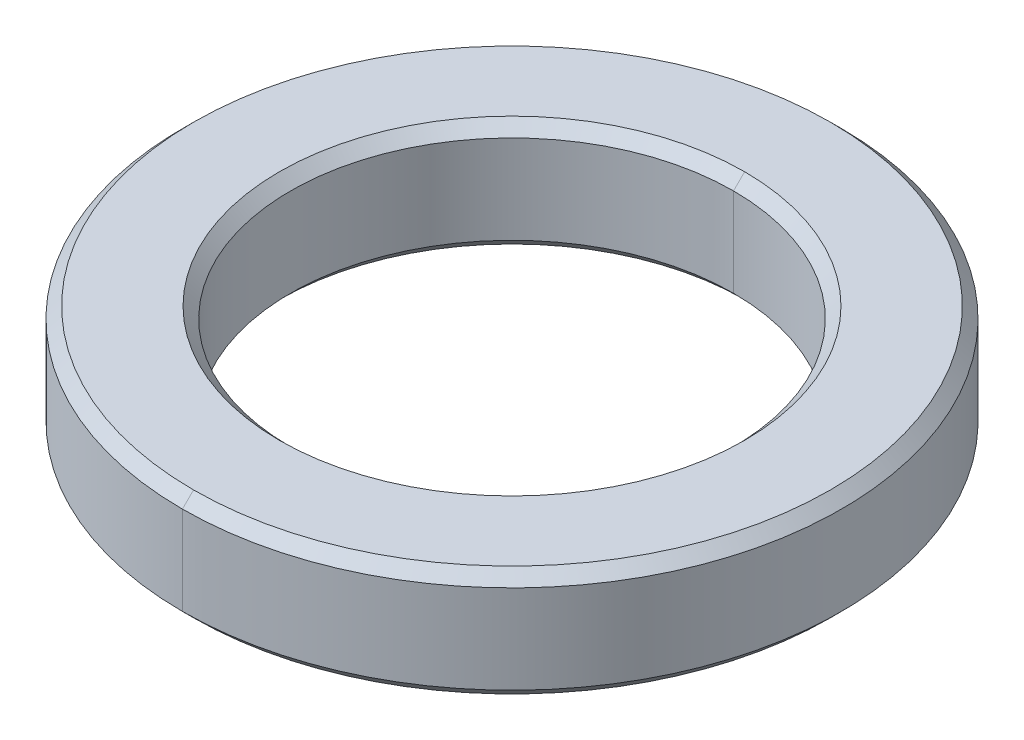
ISO-10303-21;
HEADER;
FILE_DESCRIPTION(('STEP AP214'),'2;1');
FILE_NAME('part.step','',(''),(''),'','','');
FILE_SCHEMA(('AUTOMOTIVE_DESIGN { 1 0 10303 214 1 1 1 1 }'));
ENDSEC;
DATA;
#1=APPLICATION_CONTEXT('core data for automotive mechanical design processes');
#2=APPLICATION_PROTOCOL_DEFINITION('international standard','automotive_design',2000,#1);
#3=PRODUCT_CONTEXT('',#1,'mechanical');
#4=PRODUCT('Part','Part','',(#3));
#5=PRODUCT_RELATED_PRODUCT_CATEGORY('part','',(#4));
#6=PRODUCT_DEFINITION_FORMATION('','',#4);
#7=PRODUCT_DEFINITION_CONTEXT('part definition',#1,'design');
#8=PRODUCT_DEFINITION('design','',#6,#7);
#9=PRODUCT_DEFINITION_SHAPE('','',#8);
#10=(LENGTH_UNIT() NAMED_UNIT(*) SI_UNIT(.MILLI.,.METRE.));
#11=(NAMED_UNIT(*) PLANE_ANGLE_UNIT() SI_UNIT($,.RADIAN.));
#12=(NAMED_UNIT(*) SI_UNIT($,.STERADIAN.) SOLID_ANGLE_UNIT());
#13=UNCERTAINTY_MEASURE_WITH_UNIT(LENGTH_MEASURE(1.E-05),#10,'distance_accuracy_value','');
#14=(GEOMETRIC_REPRESENTATION_CONTEXT(3) GLOBAL_UNCERTAINTY_ASSIGNED_CONTEXT((#13)) GLOBAL_UNIT_ASSIGNED_CONTEXT((#10,
#11,#12)) REPRESENTATION_CONTEXT('',''));
#15=CARTESIAN_POINT('',(0.,0.,0.));
#16=DIRECTION('',(0.,0.,1.));
#17=DIRECTION('',(1.,0.,0.));
#18=AXIS2_PLACEMENT_3D('',#15,#16,#17);
#19=CARTESIAN_POINT('',(0.,0.4,0.));
#20=DIRECTION('',(0.,1.,0.));
#21=DIRECTION('',(0.,0.,1.));
#22=AXIS2_PLACEMENT_3D('',#19,#20,#21);
#23=CONICAL_SURFACE('',#22,2.,0.785398163397452);
#24=DIRECTION('',(0.,0.707106781186545,-0.707106781186551));
#25=VECTOR('',#24,1.);
#26=CARTESIAN_POINT('',(0.,0.4,-2.));
#27=LINE('',#26,#25);
#28=CARTESIAN_POINT('',(0.,0.4,-2.));
#29=VERTEX_POINT('',#28);
#30=CARTESIAN_POINT('',(0.,0.5,-2.1));
#31=VERTEX_POINT('',#30);
#32=EDGE_CURVE('E160',#29,#31,#27,.T.);
#33=ORIENTED_EDGE('',*,*,#32,.F.);
#34=CARTESIAN_POINT('',(0.,0.4,0.));
#35=DIRECTION('',(0.,1.,0.));
#36=DIRECTION('',(0.,0.,1.));
#37=AXIS2_PLACEMENT_3D('',#34,#35,#36);
#38=CIRCLE('',#37,2.);
#39=CARTESIAN_POINT('',(0.,0.4,2.));
#40=VERTEX_POINT('',#39);
#41=EDGE_CURVE('E24',#40,#29,#38,.T.);
#42=ORIENTED_EDGE('',*,*,#41,.F.);
#43=DIRECTION('',(0.,0.707106781186545,0.707106781186551));
#44=VECTOR('',#43,1.);
#45=CARTESIAN_POINT('',(0.,0.4,2.));
#46=LINE('',#45,#44);
#47=CARTESIAN_POINT('',(0.,0.5,2.1));
#48=VERTEX_POINT('',#47);
#49=EDGE_CURVE('E151',#40,#48,#46,.T.);
#50=ORIENTED_EDGE('',*,*,#49,.T.);
#51=CARTESIAN_POINT('',(0.,0.5,0.));
#52=DIRECTION('',(0.,-1.,0.));
#53=DIRECTION('',(0.,0.,1.));
#54=AXIS2_PLACEMENT_3D('',#51,#52,#53);
#55=CIRCLE('',#54,2.1);
#56=EDGE_CURVE('E184',#31,#48,#55,.T.);
#57=ORIENTED_EDGE('',*,*,#56,.F.);
#58=EDGE_LOOP('',(#33,#42,#50,#57));
#59=FACE_BOUND('',#58,.T.);
#60=ADVANCED_FACE('F14',(#59),#23,.F.);
#61=CARTESIAN_POINT('',(0.,-0.5,0.));
#62=DIRECTION('',(0.,-1.,0.));
#63=DIRECTION('',(0.,0.,-1.));
#64=AXIS2_PLACEMENT_3D('',#61,#62,#63);
#65=CONICAL_SURFACE('',#64,2.1,0.785398163397443);
#66=DIRECTION('',(0.,-0.707106781186551,0.707106781186545));
#67=VECTOR('',#66,1.);
#68=CARTESIAN_POINT('',(0.,-0.5,2.1));
#69=LINE('',#68,#67);
#70=CARTESIAN_POINT('',(0.,-0.4,2.));
#71=VERTEX_POINT('',#70);
#72=CARTESIAN_POINT('',(0.,-0.5,2.1));
#73=VERTEX_POINT('',#72);
#74=EDGE_CURVE('E141',#71,#73,#69,.T.);
#75=ORIENTED_EDGE('',*,*,#74,.F.);
#76=CARTESIAN_POINT('',(0.,-0.4,0.));
#77=DIRECTION('',(0.,-1.,0.));
#78=DIRECTION('',(0.,0.,1.));
#79=AXIS2_PLACEMENT_3D('',#76,#77,#78);
#80=CIRCLE('',#79,2.);
#81=CARTESIAN_POINT('',(0.,-0.4,-2.));
#82=VERTEX_POINT('',#81);
#83=EDGE_CURVE('E9',#82,#71,#80,.T.);
#84=ORIENTED_EDGE('',*,*,#83,.F.);
#85=DIRECTION('',(0.,-0.707106781186551,-0.707106781186545));
#86=VECTOR('',#85,1.);
#87=CARTESIAN_POINT('',(0.,-0.5,-2.1));
#88=LINE('',#87,#86);
#89=CARTESIAN_POINT('',(0.,-0.5,-2.1));
#90=VERTEX_POINT('',#89);
#91=EDGE_CURVE('E149',#82,#90,#88,.T.);
#92=ORIENTED_EDGE('',*,*,#91,.T.);
#93=CARTESIAN_POINT('',(0.,-0.5,0.));
#94=DIRECTION('',(0.,1.,0.));
#95=DIRECTION('',(0.,0.,1.));
#96=AXIS2_PLACEMENT_3D('',#93,#94,#95);
#97=CIRCLE('',#96,2.1);
#98=EDGE_CURVE('E116',#73,#90,#97,.T.);
#99=ORIENTED_EDGE('',*,*,#98,.F.);
#100=EDGE_LOOP('',(#75,#84,#92,#99));
#101=FACE_BOUND('',#100,.T.);
#102=ADVANCED_FACE('F142',(#101),#65,.F.);
#103=CARTESIAN_POINT('',(0.,0.5,0.));
#104=DIRECTION('',(0.,-1.,0.));
#105=DIRECTION('',(0.,0.,-1.));
#106=AXIS2_PLACEMENT_3D('',#103,#104,#105);
#107=CONICAL_SURFACE('',#106,2.875,0.785398163397448);
#108=DIRECTION('',(0.,-0.707106781186548,0.707106781186548));
#109=VECTOR('',#108,1.);
#110=CARTESIAN_POINT('',(0.,0.5,2.875));
#111=LINE('',#110,#109);
#112=CARTESIAN_POINT('',(0.,0.5,2.875));
#113=VERTEX_POINT('',#112);
#114=CARTESIAN_POINT('',(0.,0.4,2.975));
#115=VERTEX_POINT('',#114);
#116=EDGE_CURVE('E185',#113,#115,#111,.T.);
#117=ORIENTED_EDGE('',*,*,#116,.F.);
#118=CARTESIAN_POINT('',(0.,0.5,0.));
#119=DIRECTION('',(0.,1.,0.));
#120=DIRECTION('',(0.,0.,1.));
#121=AXIS2_PLACEMENT_3D('',#118,#119,#120);
#122=CIRCLE('',#121,2.875);
#123=CARTESIAN_POINT('',(0.,0.5,-2.875));
#124=VERTEX_POINT('',#123);
#125=EDGE_CURVE('E106',#124,#113,#122,.T.);
#126=ORIENTED_EDGE('',*,*,#125,.F.);
#127=DIRECTION('',(0.,-0.707106781186548,-0.707106781186548));
#128=VECTOR('',#127,1.);
#129=CARTESIAN_POINT('',(0.,0.5,-2.875));
#130=LINE('',#129,#128);
#131=CARTESIAN_POINT('',(0.,0.4,-2.975));
#132=VERTEX_POINT('',#131);
#133=EDGE_CURVE('E176',#124,#132,#130,.T.);
#134=ORIENTED_EDGE('',*,*,#133,.T.);
#135=CARTESIAN_POINT('',(0.,0.4,0.));
#136=DIRECTION('',(0.,-1.,0.));
#137=DIRECTION('',(0.,0.,1.));
#138=AXIS2_PLACEMENT_3D('',#135,#136,#137);
#139=CIRCLE('',#138,2.975);
#140=EDGE_CURVE('E203',#115,#132,#139,.T.);
#141=ORIENTED_EDGE('',*,*,#140,.F.);
#142=EDGE_LOOP('',(#117,#126,#134,#141));
#143=FACE_BOUND('',#142,.T.);
#144=ADVANCED_FACE('F359',(#143),#107,.T.);
#145=CARTESIAN_POINT('',(0.,-0.4,0.));
#146=DIRECTION('',(0.,1.,0.));
#147=DIRECTION('',(0.,0.,1.));
#148=AXIS2_PLACEMENT_3D('',#145,#146,#147);
#149=CONICAL_SURFACE('',#148,2.975,0.785398163397446);
#150=DIRECTION('',(0.,0.707106781186549,-0.707106781186546));
#151=VECTOR('',#150,1.);
#152=CARTESIAN_POINT('',(0.,-0.4,-2.975));
#153=LINE('',#152,#151);
#154=CARTESIAN_POINT('',(0.,-0.5,-2.875));
#155=VERTEX_POINT('',#154);
#156=CARTESIAN_POINT('',(0.,-0.4,-2.975));
#157=VERTEX_POINT('',#156);
#158=EDGE_CURVE('E169',#155,#157,#153,.T.);
#159=ORIENTED_EDGE('',*,*,#158,.F.);
#160=CARTESIAN_POINT('',(0.,-0.5,0.));
#161=DIRECTION('',(0.,-1.,0.));
#162=DIRECTION('',(0.,0.,1.));
#163=AXIS2_PLACEMENT_3D('',#160,#161,#162);
#164=CIRCLE('',#163,2.875);
#165=CARTESIAN_POINT('',(0.,-0.5,2.875));
#166=VERTEX_POINT('',#165);
#167=EDGE_CURVE('E190',#166,#155,#164,.T.);
#168=ORIENTED_EDGE('',*,*,#167,.F.);
#169=DIRECTION('',(0.,0.707106781186549,0.707106781186546));
#170=VECTOR('',#169,1.);
#171=CARTESIAN_POINT('',(0.,-0.4,2.975));
#172=LINE('',#171,#170);
#173=CARTESIAN_POINT('',(0.,-0.4,2.975));
#174=VERTEX_POINT('',#173);
#175=EDGE_CURVE('E139',#166,#174,#172,.T.);
#176=ORIENTED_EDGE('',*,*,#175,.T.);
#177=CARTESIAN_POINT('',(0.,-0.4,0.));
#178=DIRECTION('',(0.,1.,0.));
#179=DIRECTION('',(0.,0.,1.));
#180=AXIS2_PLACEMENT_3D('',#177,#178,#179);
#181=CIRCLE('',#180,2.975);
#182=EDGE_CURVE('E38',#157,#174,#181,.T.);
#183=ORIENTED_EDGE('',*,*,#182,.F.);
#184=EDGE_LOOP('',(#159,#168,#176,#183));
#185=FACE_BOUND('',#184,.T.);
#186=ADVANCED_FACE('F364',(#185),#149,.T.);
#187=CARTESIAN_POINT('',(0.,0.5,0.));
#188=DIRECTION('',(0.,-1.,0.));
#189=DIRECTION('',(0.,0.,-1.));
#190=AXIS2_PLACEMENT_3D('',#187,#188,#189);
#191=CYLINDRICAL_SURFACE('',#190,2.);
#192=DIRECTION('',(0.,-1.,0.));
#193=VECTOR('',#192,1.);
#194=CARTESIAN_POINT('',(0.,0.5,2.));
#195=LINE('',#194,#193);
#196=EDGE_CURVE('E18',#40,#71,#195,.T.);
#197=ORIENTED_EDGE('',*,*,#196,.F.);
#198=ORIENTED_EDGE('',*,*,#41,.T.);
#199=DIRECTION('',(0.,-1.,0.));
#200=VECTOR('',#199,1.);
#201=CARTESIAN_POINT('',(0.,0.5,-2.));
#202=LINE('',#201,#200);
#203=EDGE_CURVE('E126',#29,#82,#202,.T.);
#204=ORIENTED_EDGE('',*,*,#203,.T.);
#205=ORIENTED_EDGE('',*,*,#83,.T.);
#206=EDGE_LOOP('',(#197,#198,#204,#205));
#207=FACE_BOUND('',#206,.T.);
#208=ADVANCED_FACE('F124',(#207),#191,.F.);
#209=CARTESIAN_POINT('',(0.,0.5,0.));
#210=DIRECTION('',(0.,-1.,0.));
#211=DIRECTION('',(0.,0.,-1.));
#212=AXIS2_PLACEMENT_3D('',#209,#210,#211);
#213=CYLINDRICAL_SURFACE('',#212,2.975);
#214=DIRECTION('',(0.,-1.,0.));
#215=VECTOR('',#214,1.);
#216=CARTESIAN_POINT('',(0.,0.5,2.975));
#217=LINE('',#216,#215);
#218=EDGE_CURVE('E175',#115,#174,#217,.T.);
#219=ORIENTED_EDGE('',*,*,#218,.F.);
#220=ORIENTED_EDGE('',*,*,#140,.T.);
#221=DIRECTION('',(0.,-1.,0.));
#222=VECTOR('',#221,1.);
#223=CARTESIAN_POINT('',(0.,0.5,-2.975));
#224=LINE('',#223,#222);
#225=EDGE_CURVE('E172',#132,#157,#224,.T.);
#226=ORIENTED_EDGE('',*,*,#225,.T.);
#227=ORIENTED_EDGE('',*,*,#182,.T.);
#228=EDGE_LOOP('',(#219,#220,#226,#227));
#229=FACE_BOUND('',#228,.T.);
#230=ADVANCED_FACE('F341',(#229),#213,.T.);
#231=CARTESIAN_POINT('',(0.,-0.5,0.));
#232=DIRECTION('',(0.,1.,0.));
#233=DIRECTION('',(1.,0.,0.));
#234=AXIS2_PLACEMENT_3D('',#231,#232,#233);
#235=PLANE('',#234);
#236=CARTESIAN_POINT('',(0.,-0.5,0.));
#237=DIRECTION('',(0.,1.,0.));
#238=DIRECTION('',(0.,0.,1.));
#239=AXIS2_PLACEMENT_3D('',#236,#237,#238);
#240=CIRCLE('',#239,2.1);
#241=EDGE_CURVE('E146',#90,#73,#240,.T.);
#242=ORIENTED_EDGE('',*,*,#241,.T.);
#243=ORIENTED_EDGE('',*,*,#98,.T.);
#244=EDGE_LOOP('',(#242,#243));
#245=FACE_BOUND('',#244,.T.);
#246=ORIENTED_EDGE('',*,*,#167,.T.);
#247=CARTESIAN_POINT('',(0.,-0.5,0.));
#248=DIRECTION('',(0.,-1.,0.));
#249=DIRECTION('',(0.,0.,1.));
#250=AXIS2_PLACEMENT_3D('',#247,#248,#249);
#251=CIRCLE('',#250,2.875);
#252=EDGE_CURVE('E180',#155,#166,#251,.T.);
#253=ORIENTED_EDGE('',*,*,#252,.T.);
#254=EDGE_LOOP('',(#246,#253));
#255=FACE_BOUND('',#254,.T.);
#256=ADVANCED_FACE('F233',(#245,#255),#235,.F.);
#257=CARTESIAN_POINT('',(0.,0.5,0.));
#258=DIRECTION('',(0.,1.,0.));
#259=DIRECTION('',(1.,0.,0.));
#260=AXIS2_PLACEMENT_3D('',#257,#258,#259);
#261=PLANE('',#260);
#262=CARTESIAN_POINT('',(0.,0.5,0.));
#263=DIRECTION('',(0.,-1.,0.));
#264=DIRECTION('',(0.,0.,1.));
#265=AXIS2_PLACEMENT_3D('',#262,#263,#264);
#266=CIRCLE('',#265,2.1);
#267=EDGE_CURVE('E157',#48,#31,#266,.T.);
#268=ORIENTED_EDGE('',*,*,#267,.T.);
#269=ORIENTED_EDGE('',*,*,#56,.T.);
#270=EDGE_LOOP('',(#268,#269));
#271=FACE_BOUND('',#270,.T.);
#272=ORIENTED_EDGE('',*,*,#125,.T.);
#273=CARTESIAN_POINT('',(0.,0.5,0.));
#274=DIRECTION('',(0.,1.,0.));
#275=DIRECTION('',(0.,0.,1.));
#276=AXIS2_PLACEMENT_3D('',#273,#274,#275);
#277=CIRCLE('',#276,2.875);
#278=EDGE_CURVE('E188',#113,#124,#277,.T.);
#279=ORIENTED_EDGE('',*,*,#278,.T.);
#280=EDGE_LOOP('',(#272,#279));
#281=FACE_BOUND('',#280,.T.);
#282=ADVANCED_FACE('F335',(#271,#281),#261,.T.);
#283=CARTESIAN_POINT('',(0.,0.5,0.));
#284=DIRECTION('',(0.,-1.,0.));
#285=DIRECTION('',(0.,0.,-1.));
#286=AXIS2_PLACEMENT_3D('',#283,#284,#285);
#287=CYLINDRICAL_SURFACE('',#286,2.975);
#288=CARTESIAN_POINT('',(0.,0.4,0.));
#289=DIRECTION('',(0.,-1.,0.));
#290=DIRECTION('',(0.,0.,1.));
#291=AXIS2_PLACEMENT_3D('',#288,#289,#290);
#292=CIRCLE('',#291,2.975);
#293=EDGE_CURVE('E181',#132,#115,#292,.T.);
#294=ORIENTED_EDGE('',*,*,#293,.T.);
#295=ORIENTED_EDGE('',*,*,#218,.T.);
#296=CARTESIAN_POINT('',(0.,-0.4,0.));
#297=DIRECTION('',(0.,1.,0.));
#298=DIRECTION('',(0.,0.,1.));
#299=AXIS2_PLACEMENT_3D('',#296,#297,#298);
#300=CIRCLE('',#299,2.975);
#301=EDGE_CURVE('E165',#174,#157,#300,.T.);
#302=ORIENTED_EDGE('',*,*,#301,.T.);
#303=ORIENTED_EDGE('',*,*,#225,.F.);
#304=EDGE_LOOP('',(#294,#295,#302,#303));
#305=FACE_BOUND('',#304,.T.);
#306=ADVANCED_FACE('F331',(#305),#287,.T.);
#307=CARTESIAN_POINT('',(0.,0.5,0.));
#308=DIRECTION('',(0.,-1.,0.));
#309=DIRECTION('',(0.,0.,-1.));
#310=AXIS2_PLACEMENT_3D('',#307,#308,#309);
#311=CYLINDRICAL_SURFACE('',#310,2.);
#312=CARTESIAN_POINT('',(0.,0.4,0.));
#313=DIRECTION('',(0.,1.,0.));
#314=DIRECTION('',(0.,0.,1.));
#315=AXIS2_PLACEMENT_3D('',#312,#313,#314);
#316=CIRCLE('',#315,2.);
#317=EDGE_CURVE('E137',#29,#40,#316,.T.);
#318=ORIENTED_EDGE('',*,*,#317,.T.);
#319=ORIENTED_EDGE('',*,*,#196,.T.);
#320=CARTESIAN_POINT('',(0.,-0.4,0.));
#321=DIRECTION('',(0.,-1.,0.));
#322=DIRECTION('',(0.,0.,1.));
#323=AXIS2_PLACEMENT_3D('',#320,#321,#322);
#324=CIRCLE('',#323,2.);
#325=EDGE_CURVE('E135',#71,#82,#324,.T.);
#326=ORIENTED_EDGE('',*,*,#325,.T.);
#327=ORIENTED_EDGE('',*,*,#203,.F.);
#328=EDGE_LOOP('',(#318,#319,#326,#327));
#329=FACE_BOUND('',#328,.T.);
#330=ADVANCED_FACE('F133',(#329),#311,.F.);
#331=CARTESIAN_POINT('',(0.,-0.4,0.));
#332=DIRECTION('',(0.,1.,0.));
#333=DIRECTION('',(0.,0.,1.));
#334=AXIS2_PLACEMENT_3D('',#331,#332,#333);
#335=CONICAL_SURFACE('',#334,2.975,0.785398163397446);
#336=ORIENTED_EDGE('',*,*,#252,.F.);
#337=ORIENTED_EDGE('',*,*,#158,.T.);
#338=ORIENTED_EDGE('',*,*,#301,.F.);
#339=ORIENTED_EDGE('',*,*,#175,.F.);
#340=EDGE_LOOP('',(#336,#337,#338,#339));
#341=FACE_BOUND('',#340,.T.);
#342=ADVANCED_FACE('F236',(#341),#335,.T.);
#343=CARTESIAN_POINT('',(0.,0.5,0.));
#344=DIRECTION('',(0.,-1.,0.));
#345=DIRECTION('',(0.,0.,-1.));
#346=AXIS2_PLACEMENT_3D('',#343,#344,#345);
#347=CONICAL_SURFACE('',#346,2.875,0.785398163397448);
#348=ORIENTED_EDGE('',*,*,#278,.F.);
#349=ORIENTED_EDGE('',*,*,#116,.T.);
#350=ORIENTED_EDGE('',*,*,#293,.F.);
#351=ORIENTED_EDGE('',*,*,#133,.F.);
#352=EDGE_LOOP('',(#348,#349,#350,#351));
#353=FACE_BOUND('',#352,.T.);
#354=ADVANCED_FACE('F320',(#353),#347,.T.);
#355=CARTESIAN_POINT('',(0.,-0.5,0.));
#356=DIRECTION('',(0.,-1.,0.));
#357=DIRECTION('',(0.,0.,-1.));
#358=AXIS2_PLACEMENT_3D('',#355,#356,#357);
#359=CONICAL_SURFACE('',#358,2.1,0.785398163397443);
#360=ORIENTED_EDGE('',*,*,#325,.F.);
#361=ORIENTED_EDGE('',*,*,#74,.T.);
#362=ORIENTED_EDGE('',*,*,#241,.F.);
#363=ORIENTED_EDGE('',*,*,#91,.F.);
#364=EDGE_LOOP('',(#360,#361,#362,#363));
#365=FACE_BOUND('',#364,.T.);
#366=ADVANCED_FACE('F148',(#365),#359,.F.);
#367=CARTESIAN_POINT('',(0.,0.4,0.));
#368=DIRECTION('',(0.,1.,0.));
#369=DIRECTION('',(0.,0.,1.));
#370=AXIS2_PLACEMENT_3D('',#367,#368,#369);
#371=CONICAL_SURFACE('',#370,2.,0.785398163397452);
#372=ORIENTED_EDGE('',*,*,#317,.F.);
#373=ORIENTED_EDGE('',*,*,#32,.T.);
#374=ORIENTED_EDGE('',*,*,#267,.F.);
#375=ORIENTED_EDGE('',*,*,#49,.F.);
#376=EDGE_LOOP('',(#372,#373,#374,#375));
#377=FACE_BOUND('',#376,.T.);
#378=ADVANCED_FACE('F16',(#377),#371,.F.);
#379=CLOSED_SHELL('',(#60,#102,#144,#186,#208,#230,#256,#282,#306,#330,#342,#354,#366,#378));
#380=MANIFOLD_SOLID_BREP('B1',#379);
#381=ADVANCED_BREP_SHAPE_REPRESENTATION('',(#18,#380),#14);
#382=SHAPE_DEFINITION_REPRESENTATION(#9,#381);
ENDSEC;
END-ISO-10303-21;
